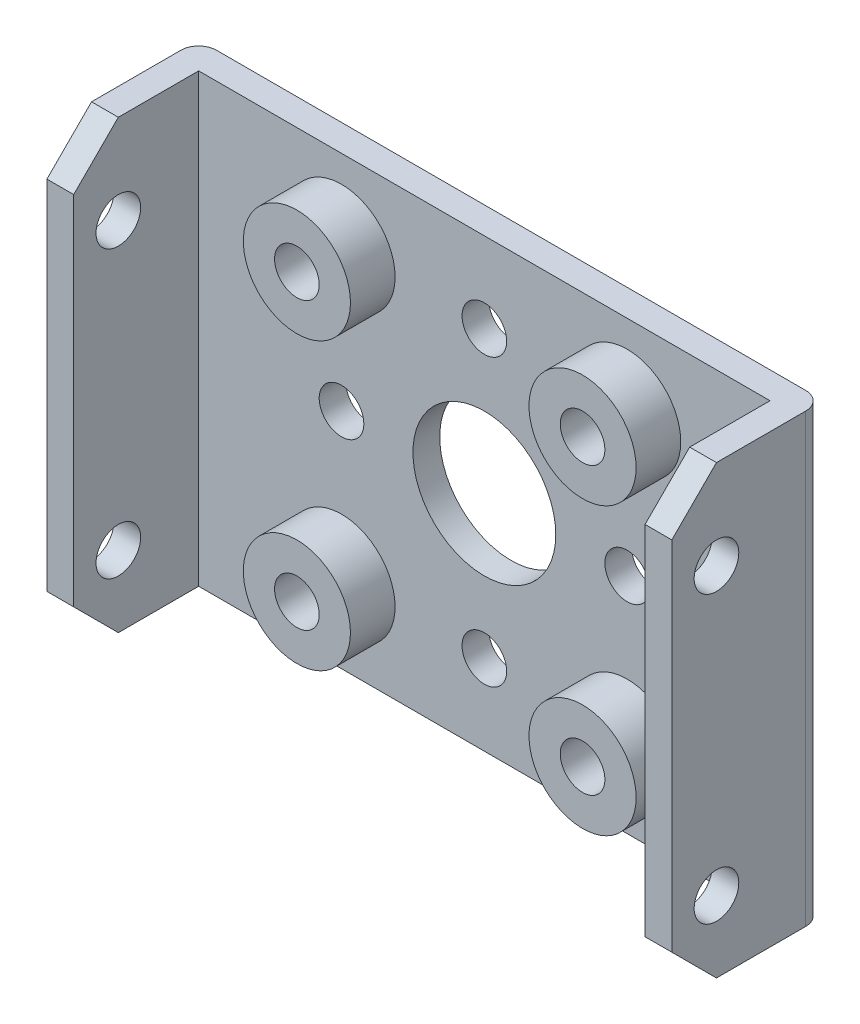
ISO-10303-21;
HEADER;
FILE_DESCRIPTION(('STEP AP214'),'2;1');
FILE_NAME('part.step','',(''),(''),'','','');
FILE_SCHEMA(('AUTOMOTIVE_DESIGN { 1 0 10303 214 1 1 1 1 }'));
ENDSEC;
DATA;
#1=APPLICATION_CONTEXT('core data for automotive mechanical design processes');
#2=APPLICATION_PROTOCOL_DEFINITION('international standard','automotive_design',2000,#1);
#3=PRODUCT_CONTEXT('',#1,'mechanical');
#4=PRODUCT('Part','Part','',(#3));
#5=PRODUCT_RELATED_PRODUCT_CATEGORY('part','',(#4));
#6=PRODUCT_DEFINITION_FORMATION('','',#4);
#7=PRODUCT_DEFINITION_CONTEXT('part definition',#1,'design');
#8=PRODUCT_DEFINITION('design','',#6,#7);
#9=PRODUCT_DEFINITION_SHAPE('','',#8);
#10=(LENGTH_UNIT() NAMED_UNIT(*) SI_UNIT(.MILLI.,.METRE.));
#11=(NAMED_UNIT(*) PLANE_ANGLE_UNIT() SI_UNIT($,.RADIAN.));
#12=(NAMED_UNIT(*) SI_UNIT($,.STERADIAN.) SOLID_ANGLE_UNIT());
#13=UNCERTAINTY_MEASURE_WITH_UNIT(LENGTH_MEASURE(1.E-05),#10,'distance_accuracy_value','');
#14=(GEOMETRIC_REPRESENTATION_CONTEXT(3) GLOBAL_UNCERTAINTY_ASSIGNED_CONTEXT((#13)) GLOBAL_UNIT_ASSIGNED_CONTEXT((#10,
#11,#12)) REPRESENTATION_CONTEXT('',''));
#15=CARTESIAN_POINT('',(0.,0.,0.));
#16=DIRECTION('',(0.,0.,1.));
#17=DIRECTION('',(1.,0.,0.));
#18=AXIS2_PLACEMENT_3D('',#15,#16,#17);
#19=CARTESIAN_POINT('',(0.,0.,8.5));
#20=DIRECTION('',(0.,0.,1.));
#21=DIRECTION('',(1.,0.,0.));
#22=AXIS2_PLACEMENT_3D('',#19,#20,#21);
#23=PLANE('',#22);
#24=DIRECTION('',(0.,-1.,0.));
#25=VECTOR('',#24,1.);
#26=CARTESIAN_POINT('',(0.,0.,8.5));
#27=LINE('',#26,#25);
#28=CARTESIAN_POINT('',(0.,22.5,8.5));
#29=VERTEX_POINT('',#28);
#30=CARTESIAN_POINT('',(0.,2.5,8.5));
#31=VERTEX_POINT('',#30);
#32=EDGE_CURVE('E197',#29,#31,#27,.T.);
#33=ORIENTED_EDGE('',*,*,#32,.T.);
#34=DIRECTION('',(1.,0.,0.));
#35=VECTOR('',#34,1.);
#36=CARTESIAN_POINT('',(1.5,2.5,8.5));
#37=LINE('',#36,#35);
#38=CARTESIAN_POINT('',(1.5,2.5,8.5));
#39=VERTEX_POINT('',#38);
#40=EDGE_CURVE('E254',#31,#39,#37,.T.);
#41=ORIENTED_EDGE('',*,*,#40,.T.);
#42=DIRECTION('',(0.,-1.,0.));
#43=VECTOR('',#42,1.);
#44=CARTESIAN_POINT('',(1.49999999999999,25.,8.5));
#45=LINE('',#44,#43);
#46=CARTESIAN_POINT('',(1.49999999999999,22.5,8.5));
#47=VERTEX_POINT('',#46);
#48=EDGE_CURVE('E182',#47,#39,#45,.T.);
#49=ORIENTED_EDGE('',*,*,#48,.F.);
#50=DIRECTION('',(-1.,0.,0.));
#51=VECTOR('',#50,1.);
#52=CARTESIAN_POINT('',(0.,22.5,8.5));
#53=LINE('',#52,#51);
#54=EDGE_CURVE('E251',#47,#29,#53,.T.);
#55=ORIENTED_EDGE('',*,*,#54,.T.);
#56=EDGE_LOOP('',(#33,#41,#49,#55));
#57=FACE_BOUND('',#56,.T.);
#58=ADVANCED_FACE('F50',(#57),#23,.T.);
#59=CARTESIAN_POINT('',(35.,0.,8.5));
#60=DIRECTION('',(-1.,0.,0.));
#61=DIRECTION('',(0.,0.,1.));
#62=AXIS2_PLACEMENT_3D('',#59,#60,#61);
#63=PLANE('',#62);
#64=CARTESIAN_POINT('',(35.,20.,6.));
#65=DIRECTION('',(-1.,0.,0.));
#66=DIRECTION('',(0.,-1.,0.));
#67=AXIS2_PLACEMENT_3D('',#64,#65,#66);
#68=CIRCLE('',#67,1.25);
#69=CARTESIAN_POINT('',(35.,18.75,6.));
#70=VERTEX_POINT('',#69);
#71=EDGE_CURVE('E268',#70,#70,#68,.T.);
#72=ORIENTED_EDGE('',*,*,#71,.T.);
#73=EDGE_LOOP('',(#72));
#74=FACE_BOUND('',#73,.T.);
#75=CARTESIAN_POINT('',(35.,4.,6.00000000000017));
#76=DIRECTION('',(-1.,0.,0.));
#77=DIRECTION('',(0.,-1.,0.));
#78=AXIS2_PLACEMENT_3D('',#75,#76,#77);
#79=CIRCLE('',#78,1.25);
#80=CARTESIAN_POINT('',(35.,2.75,6.00000000000017));
#81=VERTEX_POINT('',#80);
#82=EDGE_CURVE('E322',#81,#81,#79,.T.);
#83=ORIENTED_EDGE('',*,*,#82,.T.);
#84=EDGE_LOOP('',(#83));
#85=FACE_BOUND('',#84,.T.);
#86=DIRECTION('',(0.,1.,0.));
#87=VECTOR('',#86,1.);
#88=CARTESIAN_POINT('',(35.,0.,8.5));
#89=LINE('',#88,#87);
#90=CARTESIAN_POINT('',(35.,2.5,8.5));
#91=VERTEX_POINT('',#90);
#92=CARTESIAN_POINT('',(35.,22.5,8.5));
#93=VERTEX_POINT('',#92);
#94=EDGE_CURVE('E194',#91,#93,#89,.T.);
#95=ORIENTED_EDGE('',*,*,#94,.F.);
#96=DIRECTION('',(0.,-0.707106781186548,-0.707106781186548));
#97=VECTOR('',#96,1.);
#98=CARTESIAN_POINT('',(35.,2.5,8.5));
#99=LINE('',#98,#97);
#100=CARTESIAN_POINT('',(35.,0.,6.));
#101=VERTEX_POINT('',#100);
#102=EDGE_CURVE('E241',#91,#101,#99,.T.);
#103=ORIENTED_EDGE('',*,*,#102,.T.);
#104=DIRECTION('',(0.,0.,-1.));
#105=VECTOR('',#104,1.);
#106=CARTESIAN_POINT('',(35.,0.,8.5));
#107=LINE('',#106,#105);
#108=CARTESIAN_POINT('',(35.,0.,1.));
#109=VERTEX_POINT('',#108);
#110=EDGE_CURVE('E201',#101,#109,#107,.T.);
#111=ORIENTED_EDGE('',*,*,#110,.T.);
#112=DIRECTION('',(0.,1.,0.));
#113=VECTOR('',#112,1.);
#114=CARTESIAN_POINT('',(35.,0.,1.));
#115=LINE('',#114,#113);
#116=CARTESIAN_POINT('',(35.,25.,1.));
#117=VERTEX_POINT('',#116);
#118=EDGE_CURVE('E213',#109,#117,#115,.T.);
#119=ORIENTED_EDGE('',*,*,#118,.T.);
#120=DIRECTION('',(0.,0.,-1.));
#121=VECTOR('',#120,1.);
#122=CARTESIAN_POINT('',(35.,25.,8.5));
#123=LINE('',#122,#121);
#124=CARTESIAN_POINT('',(35.,25.,5.99999999999998));
#125=VERTEX_POINT('',#124);
#126=EDGE_CURVE('E211',#125,#117,#123,.T.);
#127=ORIENTED_EDGE('',*,*,#126,.F.);
#128=DIRECTION('',(0.,-0.707106781186547,0.707106781186549));
#129=VECTOR('',#128,1.);
#130=CARTESIAN_POINT('',(35.,22.5,8.5));
#131=LINE('',#130,#129);
#132=EDGE_CURVE('E239',#125,#93,#131,.T.);
#133=ORIENTED_EDGE('',*,*,#132,.T.);
#134=EDGE_LOOP('',(#95,#103,#111,#119,#127,#133));
#135=FACE_BOUND('',#134,.T.);
#136=ADVANCED_FACE('F353',(#74,#85,#135),#63,.F.);
#137=CARTESIAN_POINT('',(35.,25.,8.5));
#138=DIRECTION('',(0.,-1.,0.));
#139=DIRECTION('',(1.,0.,0.));
#140=AXIS2_PLACEMENT_3D('',#137,#138,#139);
#141=PLANE('',#140);
#142=DIRECTION('',(0.,0.,1.));
#143=VECTOR('',#142,1.);
#144=CARTESIAN_POINT('',(33.5,25.,1.5));
#145=LINE('',#144,#143);
#146=CARTESIAN_POINT('',(33.5,25.,1.5));
#147=VERTEX_POINT('',#146);
#148=CARTESIAN_POINT('',(33.5,25.,5.99999999999998));
#149=VERTEX_POINT('',#148);
#150=EDGE_CURVE('E190',#147,#149,#145,.T.);
#151=ORIENTED_EDGE('',*,*,#150,.T.);
#152=DIRECTION('',(1.,0.,0.));
#153=VECTOR('',#152,1.);
#154=CARTESIAN_POINT('',(35.,25.,5.99999999999998));
#155=LINE('',#154,#153);
#156=EDGE_CURVE('E13',#149,#125,#155,.T.);
#157=ORIENTED_EDGE('',*,*,#156,.T.);
#158=ORIENTED_EDGE('',*,*,#126,.T.);
#159=CARTESIAN_POINT('',(34.,25.,1.));
#160=DIRECTION('',(0.,-1.,0.));
#161=DIRECTION('',(1.,0.,0.));
#162=AXIS2_PLACEMENT_3D('',#159,#160,#161);
#163=CIRCLE('',#162,1.);
#164=CARTESIAN_POINT('',(34.,25.,0.));
#165=VERTEX_POINT('',#164);
#166=EDGE_CURVE('E219',#117,#165,#163,.F.);
#167=ORIENTED_EDGE('',*,*,#166,.T.);
#168=DIRECTION('',(-1.,0.,0.));
#169=VECTOR('',#168,1.);
#170=CARTESIAN_POINT('',(35.,25.,0.));
#171=LINE('',#170,#169);
#172=CARTESIAN_POINT('',(1.,25.,0.));
#173=VERTEX_POINT('',#172);
#174=EDGE_CURVE('E189',#165,#173,#171,.T.);
#175=ORIENTED_EDGE('',*,*,#174,.T.);
#176=CARTESIAN_POINT('',(1.,25.,1.));
#177=DIRECTION('',(0.,-1.,0.));
#178=DIRECTION('',(1.,0.,0.));
#179=AXIS2_PLACEMENT_3D('',#176,#177,#178);
#180=CIRCLE('',#179,1.);
#181=CARTESIAN_POINT('',(0.,25.,1.));
#182=VERTEX_POINT('',#181);
#183=EDGE_CURVE('E216',#173,#182,#180,.F.);
#184=ORIENTED_EDGE('',*,*,#183,.T.);
#185=DIRECTION('',(0.,0.,-1.));
#186=VECTOR('',#185,1.);
#187=CARTESIAN_POINT('',(0.,25.,8.5));
#188=LINE('',#187,#186);
#189=CARTESIAN_POINT('',(0.,25.,5.99999999999999));
#190=VERTEX_POINT('',#189);
#191=EDGE_CURVE('E209',#190,#182,#188,.T.);
#192=ORIENTED_EDGE('',*,*,#191,.F.);
#193=DIRECTION('',(1.,0.,0.));
#194=VECTOR('',#193,1.);
#195=CARTESIAN_POINT('',(1.49999999999999,25.,5.99999999999999));
#196=LINE('',#195,#194);
#197=CARTESIAN_POINT('',(1.49999999999999,25.,5.99999999999999));
#198=VERTEX_POINT('',#197);
#199=EDGE_CURVE('E59',#190,#198,#196,.T.);
#200=ORIENTED_EDGE('',*,*,#199,.T.);
#201=DIRECTION('',(0.,0.,1.));
#202=VECTOR('',#201,1.);
#203=CARTESIAN_POINT('',(1.49999999999999,25.,1.5));
#204=LINE('',#203,#202);
#205=CARTESIAN_POINT('',(1.49999999999999,25.,1.5));
#206=VERTEX_POINT('',#205);
#207=EDGE_CURVE('E187',#206,#198,#204,.T.);
#208=ORIENTED_EDGE('',*,*,#207,.F.);
#209=DIRECTION('',(-1.,0.,0.));
#210=VECTOR('',#209,1.);
#211=CARTESIAN_POINT('',(1.49999999999999,25.,1.5));
#212=LINE('',#211,#210);
#213=EDGE_CURVE('E162',#147,#206,#212,.T.);
#214=ORIENTED_EDGE('',*,*,#213,.F.);
#215=EDGE_LOOP('',(#151,#157,#158,#167,#175,#184,#192,#200,#208,#214));
#216=FACE_BOUND('',#215,.T.);
#217=ADVANCED_FACE('F360',(#216),#141,.F.);
#218=CARTESIAN_POINT('',(0.,0.,8.5));
#219=DIRECTION('',(1.,0.,0.));
#220=DIRECTION('',(0.,1.,0.));
#221=AXIS2_PLACEMENT_3D('',#218,#219,#220);
#222=PLANE('',#221);
#223=CARTESIAN_POINT('',(0.,20.,6.));
#224=DIRECTION('',(-1.,0.,0.));
#225=DIRECTION('',(0.,-1.,0.));
#226=AXIS2_PLACEMENT_3D('',#223,#224,#225);
#227=CIRCLE('',#226,1.25);
#228=CARTESIAN_POINT('',(0.,18.75,6.));
#229=VERTEX_POINT('',#228);
#230=EDGE_CURVE('E319',#229,#229,#227,.T.);
#231=ORIENTED_EDGE('',*,*,#230,.F.);
#232=EDGE_LOOP('',(#231));
#233=FACE_BOUND('',#232,.T.);
#234=CARTESIAN_POINT('',(0.,4.,6.00000000000017));
#235=DIRECTION('',(-1.,0.,0.));
#236=DIRECTION('',(0.,-1.,0.));
#237=AXIS2_PLACEMENT_3D('',#234,#235,#236);
#238=CIRCLE('',#237,1.25);
#239=CARTESIAN_POINT('',(0.,2.75,6.00000000000017));
#240=VERTEX_POINT('',#239);
#241=EDGE_CURVE('E314',#240,#240,#238,.T.);
#242=ORIENTED_EDGE('',*,*,#241,.F.);
#243=EDGE_LOOP('',(#242));
#244=FACE_BOUND('',#243,.T.);
#245=DIRECTION('',(0.,0.,-1.));
#246=VECTOR('',#245,1.);
#247=CARTESIAN_POINT('',(0.,0.,8.5));
#248=LINE('',#247,#246);
#249=CARTESIAN_POINT('',(0.,0.,6.));
#250=VERTEX_POINT('',#249);
#251=CARTESIAN_POINT('',(0.,0.,1.));
#252=VERTEX_POINT('',#251);
#253=EDGE_CURVE('E207',#250,#252,#248,.T.);
#254=ORIENTED_EDGE('',*,*,#253,.F.);
#255=DIRECTION('',(0.,0.707106781186547,0.707106781186548));
#256=VECTOR('',#255,1.);
#257=CARTESIAN_POINT('',(0.,2.5,8.5));
#258=LINE('',#257,#256);
#259=EDGE_CURVE('E261',#250,#31,#258,.T.);
#260=ORIENTED_EDGE('',*,*,#259,.T.);
#261=ORIENTED_EDGE('',*,*,#32,.F.);
#262=DIRECTION('',(0.,0.707106781186547,-0.707106781186548));
#263=VECTOR('',#262,1.);
#264=CARTESIAN_POINT('',(0.,22.5,8.5));
#265=LINE('',#264,#263);
#266=EDGE_CURVE('E67',#29,#190,#265,.T.);
#267=ORIENTED_EDGE('',*,*,#266,.T.);
#268=ORIENTED_EDGE('',*,*,#191,.T.);
#269=DIRECTION('',(0.,-1.,0.));
#270=VECTOR('',#269,1.);
#271=CARTESIAN_POINT('',(0.,0.,1.));
#272=LINE('',#271,#270);
#273=EDGE_CURVE('E230',#182,#252,#272,.T.);
#274=ORIENTED_EDGE('',*,*,#273,.T.);
#275=EDGE_LOOP('',(#254,#260,#261,#267,#268,#274));
#276=FACE_BOUND('',#275,.T.);
#277=ADVANCED_FACE('F373',(#233,#244,#276),#222,.F.);
#278=CARTESIAN_POINT('',(35.,0.,8.5));
#279=DIRECTION('',(0.,1.,0.));
#280=DIRECTION('',(-1.,0.,0.));
#281=AXIS2_PLACEMENT_3D('',#278,#279,#280);
#282=PLANE('',#281);
#283=ORIENTED_EDGE('',*,*,#110,.F.);
#284=DIRECTION('',(-1.,0.,0.));
#285=VECTOR('',#284,1.);
#286=CARTESIAN_POINT('',(33.5,0.,6.));
#287=LINE('',#286,#285);
#288=CARTESIAN_POINT('',(33.5,0.,6.));
#289=VERTEX_POINT('',#288);
#290=EDGE_CURVE('E245',#101,#289,#287,.T.);
#291=ORIENTED_EDGE('',*,*,#290,.T.);
#292=DIRECTION('',(0.,0.,1.));
#293=VECTOR('',#292,1.);
#294=CARTESIAN_POINT('',(33.5,0.,1.5));
#295=LINE('',#294,#293);
#296=CARTESIAN_POINT('',(33.5,0.,1.5));
#297=VERTEX_POINT('',#296);
#298=EDGE_CURVE('E161',#297,#289,#295,.T.);
#299=ORIENTED_EDGE('',*,*,#298,.F.);
#300=DIRECTION('',(1.,0.,0.));
#301=VECTOR('',#300,1.);
#302=CARTESIAN_POINT('',(1.5,0.,1.5));
#303=LINE('',#302,#301);
#304=CARTESIAN_POINT('',(1.5,0.,1.5));
#305=VERTEX_POINT('',#304);
#306=EDGE_CURVE('E168',#305,#297,#303,.T.);
#307=ORIENTED_EDGE('',*,*,#306,.F.);
#308=DIRECTION('',(0.,0.,1.));
#309=VECTOR('',#308,1.);
#310=CARTESIAN_POINT('',(1.5,0.,1.5));
#311=LINE('',#310,#309);
#312=CARTESIAN_POINT('',(1.5,0.,6.));
#313=VERTEX_POINT('',#312);
#314=EDGE_CURVE('E151',#305,#313,#311,.T.);
#315=ORIENTED_EDGE('',*,*,#314,.T.);
#316=DIRECTION('',(-1.,0.,0.));
#317=VECTOR('',#316,1.);
#318=CARTESIAN_POINT('',(0.,0.,6.));
#319=LINE('',#318,#317);
#320=EDGE_CURVE('E243',#313,#250,#319,.T.);
#321=ORIENTED_EDGE('',*,*,#320,.T.);
#322=ORIENTED_EDGE('',*,*,#253,.T.);
#323=CARTESIAN_POINT('',(1.,0.,1.));
#324=DIRECTION('',(0.,1.,0.));
#325=DIRECTION('',(-1.,0.,0.));
#326=AXIS2_PLACEMENT_3D('',#323,#324,#325);
#327=CIRCLE('',#326,1.);
#328=CARTESIAN_POINT('',(1.,0.,0.));
#329=VERTEX_POINT('',#328);
#330=EDGE_CURVE('E225',#252,#329,#327,.F.);
#331=ORIENTED_EDGE('',*,*,#330,.T.);
#332=DIRECTION('',(1.,0.,0.));
#333=VECTOR('',#332,1.);
#334=CARTESIAN_POINT('',(35.,0.,0.));
#335=LINE('',#334,#333);
#336=CARTESIAN_POINT('',(34.,0.,0.));
#337=VERTEX_POINT('',#336);
#338=EDGE_CURVE('E198',#329,#337,#335,.T.);
#339=ORIENTED_EDGE('',*,*,#338,.T.);
#340=CARTESIAN_POINT('',(34.,0.,1.));
#341=DIRECTION('',(0.,1.,0.));
#342=DIRECTION('',(-1.,0.,0.));
#343=AXIS2_PLACEMENT_3D('',#340,#341,#342);
#344=CIRCLE('',#343,1.);
#345=EDGE_CURVE('E227',#337,#109,#344,.F.);
#346=ORIENTED_EDGE('',*,*,#345,.T.);
#347=EDGE_LOOP('',(#283,#291,#299,#307,#315,#321,#322,#331,#339,#346));
#348=FACE_BOUND('',#347,.T.);
#349=ADVANCED_FACE('F174',(#348),#282,.F.);
#350=DIRECTION('',(0.,1.,0.));
#351=VECTOR('',#350,1.);
#352=CARTESIAN_POINT('',(33.5,25.,8.5));
#353=LINE('',#352,#351);
#354=CARTESIAN_POINT('',(33.5,2.50000000000001,8.5));
#355=VERTEX_POINT('',#354);
#356=CARTESIAN_POINT('',(33.5,22.5,8.5));
#357=VERTEX_POINT('',#356);
#358=EDGE_CURVE('E171',#355,#357,#353,.T.);
#359=ORIENTED_EDGE('',*,*,#358,.F.);
#360=DIRECTION('',(1.,0.,0.));
#361=VECTOR('',#360,1.);
#362=CARTESIAN_POINT('',(35.,2.5,8.5));
#363=LINE('',#362,#361);
#364=EDGE_CURVE('E236',#355,#91,#363,.T.);
#365=ORIENTED_EDGE('',*,*,#364,.T.);
#366=ORIENTED_EDGE('',*,*,#94,.T.);
#367=DIRECTION('',(-1.,0.,0.));
#368=VECTOR('',#367,1.);
#369=CARTESIAN_POINT('',(33.5,22.5,8.5));
#370=LINE('',#369,#368);
#371=EDGE_CURVE('E233',#93,#357,#370,.T.);
#372=ORIENTED_EDGE('',*,*,#371,.T.);
#373=EDGE_LOOP('',(#359,#365,#366,#372));
#374=FACE_BOUND('',#373,.T.);
#375=ADVANCED_FACE('F356',(#374),#23,.T.);
#376=CARTESIAN_POINT('',(0.,0.,0.));
#377=DIRECTION('',(0.,0.,1.));
#378=DIRECTION('',(1.,0.,0.));
#379=AXIS2_PLACEMENT_3D('',#376,#377,#378);
#380=PLANE('',#379);
#381=CARTESIAN_POINT('',(17.5,20.5000000000001,0.));
#382=DIRECTION('',(0.,0.,1.));
#383=DIRECTION('',(1.,0.,0.));
#384=AXIS2_PLACEMENT_3D('',#381,#382,#383);
#385=CIRCLE('',#384,1.25);
#386=CARTESIAN_POINT('',(18.75,20.5000000000001,0.));
#387=VERTEX_POINT('',#386);
#388=EDGE_CURVE('E716',#387,#387,#385,.T.);
#389=ORIENTED_EDGE('',*,*,#388,.T.);
#390=EDGE_LOOP('',(#389));
#391=FACE_BOUND('',#390,.T.);
#392=CARTESIAN_POINT('',(25.5000000000001,12.5000000000002,0.));
#393=DIRECTION('',(0.,0.,1.));
#394=DIRECTION('',(1.,0.,0.));
#395=AXIS2_PLACEMENT_3D('',#392,#393,#394);
#396=CIRCLE('',#395,1.25);
#397=CARTESIAN_POINT('',(26.7500000000001,12.5000000000002,0.));
#398=VERTEX_POINT('',#397);
#399=EDGE_CURVE('E717',#398,#398,#396,.T.);
#400=ORIENTED_EDGE('',*,*,#399,.T.);
#401=EDGE_LOOP('',(#400));
#402=FACE_BOUND('',#401,.T.);
#403=CARTESIAN_POINT('',(17.5,12.5,0.));
#404=DIRECTION('',(0.,0.,1.));
#405=DIRECTION('',(1.,0.,0.));
#406=AXIS2_PLACEMENT_3D('',#403,#404,#405);
#407=CIRCLE('',#406,4.);
#408=CARTESIAN_POINT('',(21.5,12.5,0.));
#409=VERTEX_POINT('',#408);
#410=EDGE_CURVE('E721',#409,#409,#407,.T.);
#411=ORIENTED_EDGE('',*,*,#410,.T.);
#412=EDGE_LOOP('',(#411));
#413=FACE_BOUND('',#412,.T.);
#414=CARTESIAN_POINT('',(25.5000000000001,4.50000000000022,0.));
#415=DIRECTION('',(0.,0.,1.));
#416=DIRECTION('',(1.,0.,0.));
#417=AXIS2_PLACEMENT_3D('',#414,#415,#416);
#418=CIRCLE('',#417,1.25);
#419=CARTESIAN_POINT('',(26.7500000000001,4.50000000000022,0.));
#420=VERTEX_POINT('',#419);
#421=EDGE_CURVE('E728',#420,#420,#418,.T.);
#422=ORIENTED_EDGE('',*,*,#421,.T.);
#423=EDGE_LOOP('',(#422));
#424=FACE_BOUND('',#423,.T.);
#425=CARTESIAN_POINT('',(9.50000000000004,20.5,0.));
#426=DIRECTION('',(0.,0.,1.));
#427=DIRECTION('',(1.,0.,0.));
#428=AXIS2_PLACEMENT_3D('',#425,#426,#427);
#429=CIRCLE('',#428,1.25);
#430=CARTESIAN_POINT('',(10.75,20.5,0.));
#431=VERTEX_POINT('',#430);
#432=EDGE_CURVE('E748',#431,#431,#429,.T.);
#433=ORIENTED_EDGE('',*,*,#432,.T.);
#434=EDGE_LOOP('',(#433));
#435=FACE_BOUND('',#434,.T.);
#436=CARTESIAN_POINT('',(9.50000000000007,12.5,0.));
#437=DIRECTION('',(0.,0.,1.));
#438=DIRECTION('',(1.,0.,0.));
#439=AXIS2_PLACEMENT_3D('',#436,#437,#438);
#440=CIRCLE('',#439,1.25);
#441=CARTESIAN_POINT('',(10.7500000000001,12.5,0.));
#442=VERTEX_POINT('',#441);
#443=EDGE_CURVE('E752',#442,#442,#440,.T.);
#444=ORIENTED_EDGE('',*,*,#443,.T.);
#445=EDGE_LOOP('',(#444));
#446=FACE_BOUND('',#445,.T.);
#447=CARTESIAN_POINT('',(9.5000000000001,4.5,0.));
#448=DIRECTION('',(0.,0.,1.));
#449=DIRECTION('',(1.,0.,0.));
#450=AXIS2_PLACEMENT_3D('',#447,#448,#449);
#451=CIRCLE('',#450,1.25);
#452=CARTESIAN_POINT('',(10.7500000000001,4.5,0.));
#453=VERTEX_POINT('',#452);
#454=EDGE_CURVE('E756',#453,#453,#451,.T.);
#455=ORIENTED_EDGE('',*,*,#454,.T.);
#456=EDGE_LOOP('',(#455));
#457=FACE_BOUND('',#456,.T.);
#458=CARTESIAN_POINT('',(25.5,20.5000000000002,0.));
#459=DIRECTION('',(0.,0.,1.));
#460=DIRECTION('',(1.,0.,0.));
#461=AXIS2_PLACEMENT_3D('',#458,#459,#460);
#462=CIRCLE('',#461,1.25);
#463=CARTESIAN_POINT('',(26.75,20.5000000000002,0.));
#464=VERTEX_POINT('',#463);
#465=EDGE_CURVE('E724',#464,#464,#462,.T.);
#466=ORIENTED_EDGE('',*,*,#465,.T.);
#467=EDGE_LOOP('',(#466));
#468=FACE_BOUND('',#467,.T.);
#469=CARTESIAN_POINT('',(17.5000000000001,4.50000000000011,0.));
#470=DIRECTION('',(0.,0.,1.));
#471=DIRECTION('',(1.,0.,0.));
#472=AXIS2_PLACEMENT_3D('',#469,#470,#471);
#473=CIRCLE('',#472,1.25);
#474=CARTESIAN_POINT('',(18.7500000000001,4.50000000000011,0.));
#475=VERTEX_POINT('',#474);
#476=EDGE_CURVE('E276',#475,#475,#473,.T.);
#477=ORIENTED_EDGE('',*,*,#476,.T.);
#478=EDGE_LOOP('',(#477));
#479=FACE_BOUND('',#478,.T.);
#480=ORIENTED_EDGE('',*,*,#174,.F.);
#481=DIRECTION('',(0.,1.,0.));
#482=VECTOR('',#481,1.);
#483=CARTESIAN_POINT('',(34.,0.,0.));
#484=LINE('',#483,#482);
#485=EDGE_CURVE('E223',#165,#337,#484,.F.);
#486=ORIENTED_EDGE('',*,*,#485,.T.);
#487=ORIENTED_EDGE('',*,*,#338,.F.);
#488=DIRECTION('',(0.,-1.,0.));
#489=VECTOR('',#488,1.);
#490=CARTESIAN_POINT('',(1.,0.,0.));
#491=LINE('',#490,#489);
#492=EDGE_CURVE('E221',#329,#173,#491,.F.);
#493=ORIENTED_EDGE('',*,*,#492,.T.);
#494=EDGE_LOOP('',(#480,#486,#487,#493));
#495=FACE_BOUND('',#494,.T.);
#496=ADVANCED_FACE('F366',(#391,#402,#413,#424,#435,#446,#457,#468,#479,#495),#380,.F.);
#497=CARTESIAN_POINT('',(1.49999999999999,25.,1.5));
#498=DIRECTION('',(-1.,0.,0.));
#499=DIRECTION('',(0.,-1.,0.));
#500=AXIS2_PLACEMENT_3D('',#497,#498,#499);
#501=PLANE('',#500);
#502=CARTESIAN_POINT('',(1.49999999999999,20.,6.));
#503=DIRECTION('',(-1.,0.,0.));
#504=DIRECTION('',(0.,-1.,0.));
#505=AXIS2_PLACEMENT_3D('',#502,#503,#504);
#506=CIRCLE('',#505,1.25);
#507=CARTESIAN_POINT('',(1.49999999999999,18.75,6.));
#508=VERTEX_POINT('',#507);
#509=EDGE_CURVE('E184',#508,#508,#506,.T.);
#510=ORIENTED_EDGE('',*,*,#509,.T.);
#511=EDGE_LOOP('',(#510));
#512=FACE_BOUND('',#511,.T.);
#513=CARTESIAN_POINT('',(1.49999999999999,4.,6.00000000000017));
#514=DIRECTION('',(-1.,0.,0.));
#515=DIRECTION('',(0.,-1.,0.));
#516=AXIS2_PLACEMENT_3D('',#513,#514,#515);
#517=CIRCLE('',#516,1.25);
#518=CARTESIAN_POINT('',(1.49999999999999,2.75,6.00000000000017));
#519=VERTEX_POINT('',#518);
#520=EDGE_CURVE('E267',#519,#519,#517,.T.);
#521=ORIENTED_EDGE('',*,*,#520,.T.);
#522=EDGE_LOOP('',(#521));
#523=FACE_BOUND('',#522,.T.);
#524=ORIENTED_EDGE('',*,*,#48,.T.);
#525=DIRECTION('',(0.,-0.707106781186547,-0.707106781186548));
#526=VECTOR('',#525,1.);
#527=CARTESIAN_POINT('',(1.5,2.5,8.5));
#528=LINE('',#527,#526);
#529=EDGE_CURVE('E157',#39,#313,#528,.T.);
#530=ORIENTED_EDGE('',*,*,#529,.T.);
#531=ORIENTED_EDGE('',*,*,#314,.F.);
#532=DIRECTION('',(0.,-1.,0.));
#533=VECTOR('',#532,1.);
#534=CARTESIAN_POINT('',(1.49999999999999,25.,1.5));
#535=LINE('',#534,#533);
#536=EDGE_CURVE('E155',#206,#305,#535,.T.);
#537=ORIENTED_EDGE('',*,*,#536,.F.);
#538=ORIENTED_EDGE('',*,*,#207,.T.);
#539=DIRECTION('',(0.,-0.707106781186547,0.707106781186548));
#540=VECTOR('',#539,1.);
#541=CARTESIAN_POINT('',(1.49999999999999,22.5,8.5));
#542=LINE('',#541,#540);
#543=EDGE_CURVE('E257',#198,#47,#542,.T.);
#544=ORIENTED_EDGE('',*,*,#543,.T.);
#545=EDGE_LOOP('',(#524,#530,#531,#537,#538,#544));
#546=FACE_BOUND('',#545,.T.);
#547=ADVANCED_FACE('F154',(#512,#523,#546),#501,.F.);
#548=CARTESIAN_POINT('',(33.5,25.,1.5));
#549=DIRECTION('',(1.,0.,0.));
#550=DIRECTION('',(0.,0.,-1.));
#551=AXIS2_PLACEMENT_3D('',#548,#549,#550);
#552=PLANE('',#551);
#553=CARTESIAN_POINT('',(33.5,20.,6.));
#554=DIRECTION('',(1.,0.,0.));
#555=DIRECTION('',(0.,0.,-1.));
#556=AXIS2_PLACEMENT_3D('',#553,#554,#555);
#557=CIRCLE('',#556,1.25);
#558=CARTESIAN_POINT('',(33.5,20.,4.75));
#559=VERTEX_POINT('',#558);
#560=EDGE_CURVE('E269',#559,#559,#557,.T.);
#561=ORIENTED_EDGE('',*,*,#560,.T.);
#562=EDGE_LOOP('',(#561));
#563=FACE_BOUND('',#562,.T.);
#564=CARTESIAN_POINT('',(33.5,4.,6.00000000000017));
#565=DIRECTION('',(1.,0.,0.));
#566=DIRECTION('',(0.,0.,-1.));
#567=AXIS2_PLACEMENT_3D('',#564,#565,#566);
#568=CIRCLE('',#567,1.25);
#569=CARTESIAN_POINT('',(33.5,4.,4.75000000000017));
#570=VERTEX_POINT('',#569);
#571=EDGE_CURVE('E264',#570,#570,#568,.T.);
#572=ORIENTED_EDGE('',*,*,#571,.T.);
#573=EDGE_LOOP('',(#572));
#574=FACE_BOUND('',#573,.T.);
#575=ORIENTED_EDGE('',*,*,#298,.T.);
#576=DIRECTION('',(0.,0.707106781186548,0.707106781186548));
#577=VECTOR('',#576,1.);
#578=CARTESIAN_POINT('',(33.5,2.5,8.5));
#579=LINE('',#578,#577);
#580=EDGE_CURVE('E249',#289,#355,#579,.T.);
#581=ORIENTED_EDGE('',*,*,#580,.T.);
#582=ORIENTED_EDGE('',*,*,#358,.T.);
#583=DIRECTION('',(0.,0.707106781186547,-0.707106781186549));
#584=VECTOR('',#583,1.);
#585=CARTESIAN_POINT('',(33.5,22.5,8.5));
#586=LINE('',#585,#584);
#587=EDGE_CURVE('E247',#357,#149,#586,.T.);
#588=ORIENTED_EDGE('',*,*,#587,.T.);
#589=ORIENTED_EDGE('',*,*,#150,.F.);
#590=DIRECTION('',(0.,1.,0.));
#591=VECTOR('',#590,1.);
#592=CARTESIAN_POINT('',(33.5,25.,1.5));
#593=LINE('',#592,#591);
#594=EDGE_CURVE('E176',#297,#147,#593,.T.);
#595=ORIENTED_EDGE('',*,*,#594,.F.);
#596=EDGE_LOOP('',(#575,#581,#582,#588,#589,#595));
#597=FACE_BOUND('',#596,.T.);
#598=ADVANCED_FACE('F397',(#563,#574,#597),#552,.F.);
#599=CARTESIAN_POINT('',(0.,0.,1.5));
#600=DIRECTION('',(0.,0.,1.));
#601=DIRECTION('',(1.,0.,0.));
#602=AXIS2_PLACEMENT_3D('',#599,#600,#601);
#603=PLANE('',#602);
#604=CARTESIAN_POINT('',(17.5,20.5000000000001,1.5));
#605=DIRECTION('',(0.,0.,1.));
#606=DIRECTION('',(1.,0.,0.));
#607=AXIS2_PLACEMENT_3D('',#604,#605,#606);
#608=CIRCLE('',#607,1.25);
#609=CARTESIAN_POINT('',(18.75,20.5000000000001,1.5));
#610=VERTEX_POINT('',#609);
#611=EDGE_CURVE('E54',#610,#610,#608,.F.);
#612=ORIENTED_EDGE('',*,*,#611,.T.);
#613=EDGE_LOOP('',(#612));
#614=FACE_BOUND('',#613,.T.);
#615=CARTESIAN_POINT('',(25.5000000000001,12.5000000000002,1.5));
#616=DIRECTION('',(0.,0.,1.));
#617=DIRECTION('',(1.,0.,0.));
#618=AXIS2_PLACEMENT_3D('',#615,#616,#617);
#619=CIRCLE('',#618,1.25);
#620=CARTESIAN_POINT('',(26.7500000000001,12.5000000000002,1.5));
#621=VERTEX_POINT('',#620);
#622=EDGE_CURVE('E281',#621,#621,#619,.F.);
#623=ORIENTED_EDGE('',*,*,#622,.T.);
#624=EDGE_LOOP('',(#623));
#625=FACE_BOUND('',#624,.T.);
#626=CARTESIAN_POINT('',(17.5,12.5,1.5));
#627=DIRECTION('',(0.,0.,1.));
#628=DIRECTION('',(1.,0.,0.));
#629=AXIS2_PLACEMENT_3D('',#626,#627,#628);
#630=CIRCLE('',#629,4.);
#631=CARTESIAN_POINT('',(21.5,12.5,1.5));
#632=VERTEX_POINT('',#631);
#633=EDGE_CURVE('E279',#632,#632,#630,.F.);
#634=ORIENTED_EDGE('',*,*,#633,.T.);
#635=EDGE_LOOP('',(#634));
#636=FACE_BOUND('',#635,.T.);
#637=CARTESIAN_POINT('',(9.50000000000007,12.5,1.5));
#638=DIRECTION('',(0.,0.,1.));
#639=DIRECTION('',(1.,0.,0.));
#640=AXIS2_PLACEMENT_3D('',#637,#638,#639);
#641=CIRCLE('',#640,1.25);
#642=CARTESIAN_POINT('',(10.7500000000001,12.5,1.5));
#643=VERTEX_POINT('',#642);
#644=EDGE_CURVE('E275',#643,#643,#641,.F.);
#645=ORIENTED_EDGE('',*,*,#644,.T.);
#646=EDGE_LOOP('',(#645));
#647=FACE_BOUND('',#646,.T.);
#648=CARTESIAN_POINT('',(17.5000000000001,4.50000000000011,1.5));
#649=DIRECTION('',(0.,0.,1.));
#650=DIRECTION('',(1.,0.,0.));
#651=AXIS2_PLACEMENT_3D('',#648,#649,#650);
#652=CIRCLE('',#651,1.25);
#653=CARTESIAN_POINT('',(18.7500000000001,4.50000000000011,1.5));
#654=VERTEX_POINT('',#653);
#655=EDGE_CURVE('E272',#654,#654,#652,.F.);
#656=ORIENTED_EDGE('',*,*,#655,.T.);
#657=EDGE_LOOP('',(#656));
#658=FACE_BOUND('',#657,.T.);
#659=CARTESIAN_POINT('',(9.49999917106108,20.5,1.5));
#660=DIRECTION('',(0.,0.,1.));
#661=DIRECTION('',(1.,0.,0.));
#662=AXIS2_PLACEMENT_3D('',#659,#660,#661);
#663=CIRCLE('',#662,3.);
#664=CARTESIAN_POINT('',(12.4999991710611,20.5,1.5));
#665=VERTEX_POINT('',#664);
#666=EDGE_CURVE('E286',#665,#665,#663,.T.);
#667=ORIENTED_EDGE('',*,*,#666,.F.);
#668=EDGE_LOOP('',(#667));
#669=FACE_BOUND('',#668,.T.);
#670=CARTESIAN_POINT('',(25.4999991710611,20.5,1.5));
#671=DIRECTION('',(0.,0.,1.));
#672=DIRECTION('',(1.,0.,0.));
#673=AXIS2_PLACEMENT_3D('',#670,#671,#672);
#674=CIRCLE('',#673,3.);
#675=CARTESIAN_POINT('',(28.4999991710611,20.5,1.5));
#676=VERTEX_POINT('',#675);
#677=EDGE_CURVE('E295',#676,#676,#674,.T.);
#678=ORIENTED_EDGE('',*,*,#677,.F.);
#679=EDGE_LOOP('',(#678));
#680=FACE_BOUND('',#679,.T.);
#681=CARTESIAN_POINT('',(25.5,4.5,1.5));
#682=DIRECTION('',(0.,0.,1.));
#683=DIRECTION('',(1.,0.,0.));
#684=AXIS2_PLACEMENT_3D('',#681,#682,#683);
#685=CIRCLE('',#684,3.);
#686=CARTESIAN_POINT('',(28.5,4.5,1.5));
#687=VERTEX_POINT('',#686);
#688=EDGE_CURVE('E302',#687,#687,#685,.T.);
#689=ORIENTED_EDGE('',*,*,#688,.F.);
#690=EDGE_LOOP('',(#689));
#691=FACE_BOUND('',#690,.T.);
#692=CARTESIAN_POINT('',(9.49999999999999,4.5,1.5));
#693=DIRECTION('',(0.,0.,1.));
#694=DIRECTION('',(1.,0.,0.));
#695=AXIS2_PLACEMENT_3D('',#692,#693,#694);
#696=CIRCLE('',#695,3.);
#697=CARTESIAN_POINT('',(12.5,4.5,1.5));
#698=VERTEX_POINT('',#697);
#699=EDGE_CURVE('E308',#698,#698,#696,.T.);
#700=ORIENTED_EDGE('',*,*,#699,.F.);
#701=EDGE_LOOP('',(#700));
#702=FACE_BOUND('',#701,.T.);
#703=ORIENTED_EDGE('',*,*,#536,.T.);
#704=ORIENTED_EDGE('',*,*,#306,.T.);
#705=ORIENTED_EDGE('',*,*,#594,.T.);
#706=ORIENTED_EDGE('',*,*,#213,.T.);
#707=EDGE_LOOP('',(#703,#704,#705,#706));
#708=FACE_BOUND('',#707,.T.);
#709=ADVANCED_FACE('F166',(#614,#625,#636,#647,#658,#669,#680,#691,#702,#708),#603,.T.);
#710=CARTESIAN_POINT('',(34.,0.,1.));
#711=DIRECTION('',(0.,1.,0.));
#712=DIRECTION('',(0.,0.,1.));
#713=AXIS2_PLACEMENT_3D('',#710,#711,#712);
#714=CYLINDRICAL_SURFACE('',#713,1.);
#715=ORIENTED_EDGE('',*,*,#345,.F.);
#716=ORIENTED_EDGE('',*,*,#485,.F.);
#717=ORIENTED_EDGE('',*,*,#166,.F.);
#718=ORIENTED_EDGE('',*,*,#118,.F.);
#719=EDGE_LOOP('',(#715,#716,#717,#718));
#720=FACE_BOUND('',#719,.T.);
#721=ADVANCED_FACE('F391',(#720),#714,.T.);
#722=CARTESIAN_POINT('',(1.,0.,1.));
#723=DIRECTION('',(0.,-1.,0.));
#724=DIRECTION('',(1.,0.,0.));
#725=AXIS2_PLACEMENT_3D('',#722,#723,#724);
#726=CYLINDRICAL_SURFACE('',#725,1.);
#727=ORIENTED_EDGE('',*,*,#183,.F.);
#728=ORIENTED_EDGE('',*,*,#492,.F.);
#729=ORIENTED_EDGE('',*,*,#330,.F.);
#730=ORIENTED_EDGE('',*,*,#273,.F.);
#731=EDGE_LOOP('',(#727,#728,#729,#730));
#732=FACE_BOUND('',#731,.T.);
#733=ADVANCED_FACE('F412',(#732),#726,.T.);
#734=CARTESIAN_POINT('',(0.,2.5,8.5));
#735=DIRECTION('',(0.,-0.707106781186547,0.707106781186547));
#736=DIRECTION('',(-1.,0.,0.));
#737=AXIS2_PLACEMENT_3D('',#734,#735,#736);
#738=PLANE('',#737);
#739=ORIENTED_EDGE('',*,*,#580,.F.);
#740=ORIENTED_EDGE('',*,*,#290,.F.);
#741=ORIENTED_EDGE('',*,*,#102,.F.);
#742=ORIENTED_EDGE('',*,*,#364,.F.);
#743=EDGE_LOOP('',(#739,#740,#741,#742));
#744=FACE_BOUND('',#743,.T.);
#745=ADVANCED_FACE('F382',(#744),#738,.T.);
#746=CARTESIAN_POINT('',(0.,2.5,8.5));
#747=DIRECTION('',(0.,-0.707106781186548,0.707106781186547));
#748=DIRECTION('',(-1.,0.,0.));
#749=AXIS2_PLACEMENT_3D('',#746,#747,#748);
#750=PLANE('',#749);
#751=ORIENTED_EDGE('',*,*,#259,.F.);
#752=ORIENTED_EDGE('',*,*,#320,.F.);
#753=ORIENTED_EDGE('',*,*,#529,.F.);
#754=ORIENTED_EDGE('',*,*,#40,.F.);
#755=EDGE_LOOP('',(#751,#752,#753,#754));
#756=FACE_BOUND('',#755,.T.);
#757=ADVANCED_FACE('F406',(#756),#750,.T.);
#758=CARTESIAN_POINT('',(0.,22.5,8.5));
#759=DIRECTION('',(0.,0.707106781186548,0.707106781186546));
#760=DIRECTION('',(1.,0.,0.));
#761=AXIS2_PLACEMENT_3D('',#758,#759,#760);
#762=PLANE('',#761);
#763=ORIENTED_EDGE('',*,*,#132,.F.);
#764=ORIENTED_EDGE('',*,*,#156,.F.);
#765=ORIENTED_EDGE('',*,*,#587,.F.);
#766=ORIENTED_EDGE('',*,*,#371,.F.);
#767=EDGE_LOOP('',(#763,#764,#765,#766));
#768=FACE_BOUND('',#767,.T.);
#769=ADVANCED_FACE('F396',(#768),#762,.T.);
#770=CARTESIAN_POINT('',(0.,22.5,8.5));
#771=DIRECTION('',(0.,0.707106781186548,0.707106781186547));
#772=DIRECTION('',(1.,0.,0.));
#773=AXIS2_PLACEMENT_3D('',#770,#771,#772);
#774=PLANE('',#773);
#775=ORIENTED_EDGE('',*,*,#543,.F.);
#776=ORIENTED_EDGE('',*,*,#199,.F.);
#777=ORIENTED_EDGE('',*,*,#266,.F.);
#778=ORIENTED_EDGE('',*,*,#54,.F.);
#779=EDGE_LOOP('',(#775,#776,#777,#778));
#780=FACE_BOUND('',#779,.T.);
#781=ADVANCED_FACE('F52',(#780),#774,.T.);
#782=CARTESIAN_POINT('',(35.,4.,6.00000000000017));
#783=DIRECTION('',(-1.,0.,0.));
#784=DIRECTION('',(0.,-1.,0.));
#785=AXIS2_PLACEMENT_3D('',#782,#783,#784);
#786=CYLINDRICAL_SURFACE('',#785,1.25);
#787=ORIENTED_EDGE('',*,*,#82,.F.);
#788=EDGE_LOOP('',(#787));
#789=FACE_BOUND('',#788,.T.);
#790=ORIENTED_EDGE('',*,*,#571,.F.);
#791=EDGE_LOOP('',(#790));
#792=FACE_BOUND('',#791,.T.);
#793=ADVANCED_FACE('F349',(#789,#792),#786,.F.);
#794=CARTESIAN_POINT('',(35.,20.,6.));
#795=DIRECTION('',(-1.,0.,0.));
#796=DIRECTION('',(0.,-1.,0.));
#797=AXIS2_PLACEMENT_3D('',#794,#795,#796);
#798=CYLINDRICAL_SURFACE('',#797,1.25);
#799=ORIENTED_EDGE('',*,*,#71,.F.);
#800=EDGE_LOOP('',(#799));
#801=FACE_BOUND('',#800,.T.);
#802=ORIENTED_EDGE('',*,*,#560,.F.);
#803=EDGE_LOOP('',(#802));
#804=FACE_BOUND('',#803,.T.);
#805=ADVANCED_FACE('F339',(#801,#804),#798,.F.);
#806=ORIENTED_EDGE('',*,*,#241,.T.);
#807=EDGE_LOOP('',(#806));
#808=FACE_BOUND('',#807,.T.);
#809=ORIENTED_EDGE('',*,*,#520,.F.);
#810=EDGE_LOOP('',(#809));
#811=FACE_BOUND('',#810,.T.);
#812=ADVANCED_FACE('F336',(#808,#811),#786,.F.);
#813=ORIENTED_EDGE('',*,*,#230,.T.);
#814=EDGE_LOOP('',(#813));
#815=FACE_BOUND('',#814,.T.);
#816=ORIENTED_EDGE('',*,*,#509,.F.);
#817=EDGE_LOOP('',(#816));
#818=FACE_BOUND('',#817,.T.);
#819=ADVANCED_FACE('F333',(#815,#818),#798,.F.);
#820=CARTESIAN_POINT('',(9.49999999999999,4.5,4.));
#821=DIRECTION('',(0.,0.,-1.));
#822=DIRECTION('',(-1.,0.,0.));
#823=AXIS2_PLACEMENT_3D('',#820,#821,#822);
#824=CYLINDRICAL_SURFACE('',#823,3.);
#825=CARTESIAN_POINT('',(9.49999999999999,4.5,4.));
#826=DIRECTION('',(0.,0.,1.));
#827=DIRECTION('',(1.,0.,0.));
#828=AXIS2_PLACEMENT_3D('',#825,#826,#827);
#829=CIRCLE('',#828,3.);
#830=CARTESIAN_POINT('',(12.5,4.5,4.));
#831=VERTEX_POINT('',#830);
#832=EDGE_CURVE('E311',#831,#831,#829,.T.);
#833=ORIENTED_EDGE('',*,*,#832,.F.);
#834=EDGE_LOOP('',(#833));
#835=FACE_BOUND('',#834,.T.);
#836=ORIENTED_EDGE('',*,*,#699,.T.);
#837=EDGE_LOOP('',(#836));
#838=FACE_BOUND('',#837,.T.);
#839=ADVANCED_FACE('F335',(#835,#838),#824,.T.);
#840=CARTESIAN_POINT('',(9.49999999999999,4.5,4.));
#841=DIRECTION('',(0.,0.,1.));
#842=DIRECTION('',(1.,0.,0.));
#843=AXIS2_PLACEMENT_3D('',#840,#841,#842);
#844=PLANE('',#843);
#845=CARTESIAN_POINT('',(9.5000000000001,4.5,4.));
#846=DIRECTION('',(0.,0.,1.));
#847=DIRECTION('',(1.,0.,0.));
#848=AXIS2_PLACEMENT_3D('',#845,#846,#847);
#849=CIRCLE('',#848,1.25);
#850=CARTESIAN_POINT('',(10.7500000000001,4.5,4.));
#851=VERTEX_POINT('',#850);
#852=EDGE_CURVE('E760',#851,#851,#849,.T.);
#853=ORIENTED_EDGE('',*,*,#852,.F.);
#854=EDGE_LOOP('',(#853));
#855=FACE_BOUND('',#854,.T.);
#856=ORIENTED_EDGE('',*,*,#832,.T.);
#857=EDGE_LOOP('',(#856));
#858=FACE_BOUND('',#857,.T.);
#859=ADVANCED_FACE('F344',(#855,#858),#844,.T.);
#860=CARTESIAN_POINT('',(25.5,4.5,4.));
#861=DIRECTION('',(0.,0.,-1.));
#862=DIRECTION('',(-1.,0.,0.));
#863=AXIS2_PLACEMENT_3D('',#860,#861,#862);
#864=CYLINDRICAL_SURFACE('',#863,3.);
#865=CARTESIAN_POINT('',(25.5,4.5,4.));
#866=DIRECTION('',(0.,0.,1.));
#867=DIRECTION('',(1.,0.,0.));
#868=AXIS2_PLACEMENT_3D('',#865,#866,#867);
#869=CIRCLE('',#868,3.);
#870=CARTESIAN_POINT('',(28.5,4.5,4.));
#871=VERTEX_POINT('',#870);
#872=EDGE_CURVE('E305',#871,#871,#869,.T.);
#873=ORIENTED_EDGE('',*,*,#872,.F.);
#874=EDGE_LOOP('',(#873));
#875=FACE_BOUND('',#874,.T.);
#876=ORIENTED_EDGE('',*,*,#688,.T.);
#877=EDGE_LOOP('',(#876));
#878=FACE_BOUND('',#877,.T.);
#879=ADVANCED_FACE('F560',(#875,#878),#864,.T.);
#880=CARTESIAN_POINT('',(25.5,4.5,4.));
#881=DIRECTION('',(0.,0.,1.));
#882=DIRECTION('',(1.,0.,0.));
#883=AXIS2_PLACEMENT_3D('',#880,#881,#882);
#884=PLANE('',#883);
#885=CARTESIAN_POINT('',(25.5000000000001,4.50000000000022,4.));
#886=DIRECTION('',(0.,0.,1.));
#887=DIRECTION('',(1.,0.,0.));
#888=AXIS2_PLACEMENT_3D('',#885,#886,#887);
#889=CIRCLE('',#888,1.25);
#890=CARTESIAN_POINT('',(26.7500000000001,4.50000000000022,4.));
#891=VERTEX_POINT('',#890);
#892=EDGE_CURVE('E731',#891,#891,#889,.T.);
#893=ORIENTED_EDGE('',*,*,#892,.F.);
#894=EDGE_LOOP('',(#893));
#895=FACE_BOUND('',#894,.T.);
#896=ORIENTED_EDGE('',*,*,#872,.T.);
#897=EDGE_LOOP('',(#896));
#898=FACE_BOUND('',#897,.T.);
#899=ADVANCED_FACE('F569',(#895,#898),#884,.T.);
#900=CARTESIAN_POINT('',(25.4999991710611,20.5,4.));
#901=DIRECTION('',(0.,0.,-1.));
#902=DIRECTION('',(-1.,0.,0.));
#903=AXIS2_PLACEMENT_3D('',#900,#901,#902);
#904=CYLINDRICAL_SURFACE('',#903,3.);
#905=CARTESIAN_POINT('',(25.4999991710611,20.5,4.));
#906=DIRECTION('',(0.,0.,1.));
#907=DIRECTION('',(1.,0.,0.));
#908=AXIS2_PLACEMENT_3D('',#905,#906,#907);
#909=CIRCLE('',#908,3.);
#910=CARTESIAN_POINT('',(28.4999991710611,20.5,4.));
#911=VERTEX_POINT('',#910);
#912=EDGE_CURVE('E299',#911,#911,#909,.T.);
#913=ORIENTED_EDGE('',*,*,#912,.F.);
#914=EDGE_LOOP('',(#913));
#915=FACE_BOUND('',#914,.T.);
#916=ORIENTED_EDGE('',*,*,#677,.T.);
#917=EDGE_LOOP('',(#916));
#918=FACE_BOUND('',#917,.T.);
#919=ADVANCED_FACE('F578',(#915,#918),#904,.T.);
#920=CARTESIAN_POINT('',(25.4999991710611,20.5,4.));
#921=DIRECTION('',(0.,0.,1.));
#922=DIRECTION('',(1.,0.,0.));
#923=AXIS2_PLACEMENT_3D('',#920,#921,#922);
#924=PLANE('',#923);
#925=CARTESIAN_POINT('',(25.5,20.5000000000002,4.));
#926=DIRECTION('',(0.,0.,1.));
#927=DIRECTION('',(1.,0.,0.));
#928=AXIS2_PLACEMENT_3D('',#925,#926,#927);
#929=CIRCLE('',#928,1.25);
#930=CARTESIAN_POINT('',(26.75,20.5000000000002,4.));
#931=VERTEX_POINT('',#930);
#932=EDGE_CURVE('E718',#931,#931,#929,.T.);
#933=ORIENTED_EDGE('',*,*,#932,.F.);
#934=EDGE_LOOP('',(#933));
#935=FACE_BOUND('',#934,.T.);
#936=ORIENTED_EDGE('',*,*,#912,.T.);
#937=EDGE_LOOP('',(#936));
#938=FACE_BOUND('',#937,.T.);
#939=ADVANCED_FACE('F587',(#935,#938),#924,.T.);
#940=CARTESIAN_POINT('',(9.49999917106108,20.5,4.));
#941=DIRECTION('',(0.,0.,-1.));
#942=DIRECTION('',(-1.,0.,0.));
#943=AXIS2_PLACEMENT_3D('',#940,#941,#942);
#944=CYLINDRICAL_SURFACE('',#943,3.);
#945=CARTESIAN_POINT('',(9.49999917106108,20.5,4.));
#946=DIRECTION('',(0.,0.,1.));
#947=DIRECTION('',(1.,0.,0.));
#948=AXIS2_PLACEMENT_3D('',#945,#946,#947);
#949=CIRCLE('',#948,3.);
#950=CARTESIAN_POINT('',(12.4999991710611,20.5,4.));
#951=VERTEX_POINT('',#950);
#952=EDGE_CURVE('E290',#951,#951,#949,.T.);
#953=ORIENTED_EDGE('',*,*,#952,.F.);
#954=EDGE_LOOP('',(#953));
#955=FACE_BOUND('',#954,.T.);
#956=ORIENTED_EDGE('',*,*,#666,.T.);
#957=EDGE_LOOP('',(#956));
#958=FACE_BOUND('',#957,.T.);
#959=ADVANCED_FACE('F596',(#955,#958),#944,.T.);
#960=CARTESIAN_POINT('',(9.49999917106108,20.5,4.));
#961=DIRECTION('',(0.,0.,1.));
#962=DIRECTION('',(1.,0.,0.));
#963=AXIS2_PLACEMENT_3D('',#960,#961,#962);
#964=PLANE('',#963);
#965=CARTESIAN_POINT('',(9.50000000000004,20.5,4.));
#966=DIRECTION('',(0.,0.,1.));
#967=DIRECTION('',(1.,0.,0.));
#968=AXIS2_PLACEMENT_3D('',#965,#966,#967);
#969=CIRCLE('',#968,1.25);
#970=CARTESIAN_POINT('',(10.75,20.5,4.));
#971=VERTEX_POINT('',#970);
#972=EDGE_CURVE('E764',#971,#971,#969,.T.);
#973=ORIENTED_EDGE('',*,*,#972,.F.);
#974=EDGE_LOOP('',(#973));
#975=FACE_BOUND('',#974,.T.);
#976=ORIENTED_EDGE('',*,*,#952,.T.);
#977=EDGE_LOOP('',(#976));
#978=FACE_BOUND('',#977,.T.);
#979=ADVANCED_FACE('F605',(#975,#978),#964,.T.);
#980=CARTESIAN_POINT('',(9.50000000000004,20.5,4.));
#981=DIRECTION('',(0.,0.,-1.));
#982=DIRECTION('',(-1.,0.,0.));
#983=AXIS2_PLACEMENT_3D('',#980,#981,#982);
#984=CYLINDRICAL_SURFACE('',#983,1.25);
#985=ORIENTED_EDGE('',*,*,#972,.T.);
#986=EDGE_LOOP('',(#985));
#987=FACE_BOUND('',#986,.T.);
#988=ORIENTED_EDGE('',*,*,#432,.F.);
#989=EDGE_LOOP('',(#988));
#990=FACE_BOUND('',#989,.T.);
#991=ADVANCED_FACE('F613',(#987,#990),#984,.F.);
#992=CARTESIAN_POINT('',(25.5,20.5000000000002,4.));
#993=DIRECTION('',(0.,0.,-1.));
#994=DIRECTION('',(-1.,0.,0.));
#995=AXIS2_PLACEMENT_3D('',#992,#993,#994);
#996=CYLINDRICAL_SURFACE('',#995,1.25);
#997=ORIENTED_EDGE('',*,*,#932,.T.);
#998=EDGE_LOOP('',(#997));
#999=FACE_BOUND('',#998,.T.);
#1000=ORIENTED_EDGE('',*,*,#465,.F.);
#1001=EDGE_LOOP('',(#1000));
#1002=FACE_BOUND('',#1001,.T.);
#1003=ADVANCED_FACE('F622',(#999,#1002),#996,.F.);
#1004=CARTESIAN_POINT('',(25.5000000000001,4.50000000000022,4.));
#1005=DIRECTION('',(0.,0.,-1.));
#1006=DIRECTION('',(-1.,0.,0.));
#1007=AXIS2_PLACEMENT_3D('',#1004,#1005,#1006);
#1008=CYLINDRICAL_SURFACE('',#1007,1.25);
#1009=ORIENTED_EDGE('',*,*,#892,.T.);
#1010=EDGE_LOOP('',(#1009));
#1011=FACE_BOUND('',#1010,.T.);
#1012=ORIENTED_EDGE('',*,*,#421,.F.);
#1013=EDGE_LOOP('',(#1012));
#1014=FACE_BOUND('',#1013,.T.);
#1015=ADVANCED_FACE('F631',(#1011,#1014),#1008,.F.);
#1016=CARTESIAN_POINT('',(9.5000000000001,4.5,4.));
#1017=DIRECTION('',(0.,0.,-1.));
#1018=DIRECTION('',(-1.,0.,0.));
#1019=AXIS2_PLACEMENT_3D('',#1016,#1017,#1018);
#1020=CYLINDRICAL_SURFACE('',#1019,1.25);
#1021=ORIENTED_EDGE('',*,*,#852,.T.);
#1022=EDGE_LOOP('',(#1021));
#1023=FACE_BOUND('',#1022,.T.);
#1024=ORIENTED_EDGE('',*,*,#454,.F.);
#1025=EDGE_LOOP('',(#1024));
#1026=FACE_BOUND('',#1025,.T.);
#1027=ADVANCED_FACE('F640',(#1023,#1026),#1020,.F.);
#1028=CARTESIAN_POINT('',(17.5000000000001,4.50000000000011,4.));
#1029=DIRECTION('',(0.,0.,-1.));
#1030=DIRECTION('',(-1.,0.,0.));
#1031=AXIS2_PLACEMENT_3D('',#1028,#1029,#1030);
#1032=CYLINDRICAL_SURFACE('',#1031,1.25);
#1033=ORIENTED_EDGE('',*,*,#655,.F.);
#1034=EDGE_LOOP('',(#1033));
#1035=FACE_BOUND('',#1034,.T.);
#1036=ORIENTED_EDGE('',*,*,#476,.F.);
#1037=EDGE_LOOP('',(#1036));
#1038=FACE_BOUND('',#1037,.T.);
#1039=ADVANCED_FACE('F649',(#1035,#1038),#1032,.F.);
#1040=CARTESIAN_POINT('',(9.50000000000007,12.5,4.));
#1041=DIRECTION('',(0.,0.,-1.));
#1042=DIRECTION('',(-1.,0.,0.));
#1043=AXIS2_PLACEMENT_3D('',#1040,#1041,#1042);
#1044=CYLINDRICAL_SURFACE('',#1043,1.25);
#1045=ORIENTED_EDGE('',*,*,#644,.F.);
#1046=EDGE_LOOP('',(#1045));
#1047=FACE_BOUND('',#1046,.T.);
#1048=ORIENTED_EDGE('',*,*,#443,.F.);
#1049=EDGE_LOOP('',(#1048));
#1050=FACE_BOUND('',#1049,.T.);
#1051=ADVANCED_FACE('F658',(#1047,#1050),#1044,.F.);
#1052=CARTESIAN_POINT('',(17.5,12.5,4.));
#1053=DIRECTION('',(0.,0.,-1.));
#1054=DIRECTION('',(-1.,0.,0.));
#1055=AXIS2_PLACEMENT_3D('',#1052,#1053,#1054);
#1056=CYLINDRICAL_SURFACE('',#1055,4.);
#1057=ORIENTED_EDGE('',*,*,#633,.F.);
#1058=EDGE_LOOP('',(#1057));
#1059=FACE_BOUND('',#1058,.T.);
#1060=ORIENTED_EDGE('',*,*,#410,.F.);
#1061=EDGE_LOOP('',(#1060));
#1062=FACE_BOUND('',#1061,.T.);
#1063=ADVANCED_FACE('F667',(#1059,#1062),#1056,.F.);
#1064=CARTESIAN_POINT('',(25.5000000000001,12.5000000000002,4.));
#1065=DIRECTION('',(0.,0.,-1.));
#1066=DIRECTION('',(-1.,0.,0.));
#1067=AXIS2_PLACEMENT_3D('',#1064,#1065,#1066);
#1068=CYLINDRICAL_SURFACE('',#1067,1.25);
#1069=ORIENTED_EDGE('',*,*,#622,.F.);
#1070=EDGE_LOOP('',(#1069));
#1071=FACE_BOUND('',#1070,.T.);
#1072=ORIENTED_EDGE('',*,*,#399,.F.);
#1073=EDGE_LOOP('',(#1072));
#1074=FACE_BOUND('',#1073,.T.);
#1075=ADVANCED_FACE('F676',(#1071,#1074),#1068,.F.);
#1076=CARTESIAN_POINT('',(17.5,20.5000000000001,4.));
#1077=DIRECTION('',(0.,0.,-1.));
#1078=DIRECTION('',(-1.,0.,0.));
#1079=AXIS2_PLACEMENT_3D('',#1076,#1077,#1078);
#1080=CYLINDRICAL_SURFACE('',#1079,1.25);
#1081=ORIENTED_EDGE('',*,*,#611,.F.);
#1082=EDGE_LOOP('',(#1081));
#1083=FACE_BOUND('',#1082,.T.);
#1084=ORIENTED_EDGE('',*,*,#388,.F.);
#1085=EDGE_LOOP('',(#1084));
#1086=FACE_BOUND('',#1085,.T.);
#1087=ADVANCED_FACE('F685',(#1083,#1086),#1080,.F.);
#1088=CLOSED_SHELL('',(#58,#136,#217,#277,#349,#375,#496,#547,#598,#709,#721,#733,#745,#757,
#769,#781,#793,#805,#812,#819,#839,#859,#879,#899,#919,#939,#959,#979,#991,#1003,#1015,#1027,
#1039,#1051,#1063,#1075,#1087));
#1089=MANIFOLD_SOLID_BREP('B2',#1088);
#1090=ADVANCED_BREP_SHAPE_REPRESENTATION('',(#18,#1089),#14);
#1091=SHAPE_DEFINITION_REPRESENTATION(#9,#1090);
ENDSEC;
END-ISO-10303-21;
